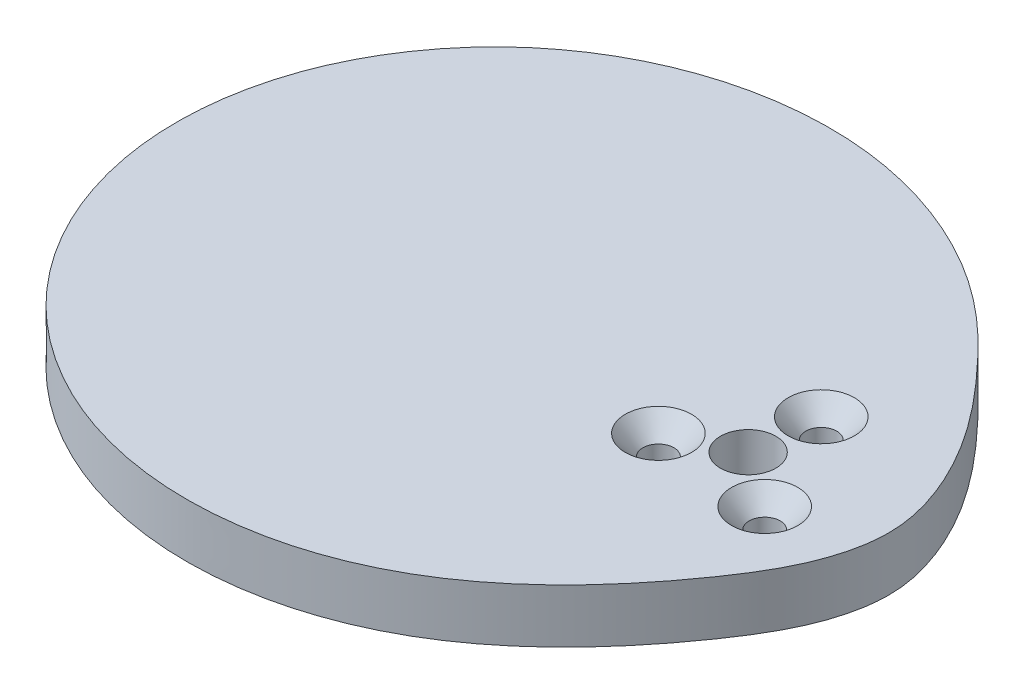
ISO-10303-21;
HEADER;
FILE_DESCRIPTION(('STEP AP214'),'2;1');
FILE_NAME('part.step','',(''),(''),'','','');
FILE_SCHEMA(('AUTOMOTIVE_DESIGN { 1 0 10303 214 1 1 1 1 }'));
ENDSEC;
DATA;
#1=APPLICATION_CONTEXT('core data for automotive mechanical design processes');
#2=APPLICATION_PROTOCOL_DEFINITION('international standard','automotive_design',2000,#1);
#3=PRODUCT_CONTEXT('',#1,'mechanical');
#4=PRODUCT('Part','Part','',(#3));
#5=PRODUCT_RELATED_PRODUCT_CATEGORY('part','',(#4));
#6=PRODUCT_DEFINITION_FORMATION('','',#4);
#7=PRODUCT_DEFINITION_CONTEXT('part definition',#1,'design');
#8=PRODUCT_DEFINITION('design','',#6,#7);
#9=PRODUCT_DEFINITION_SHAPE('','',#8);
#10=(LENGTH_UNIT() NAMED_UNIT(*) SI_UNIT(.MILLI.,.METRE.));
#11=(NAMED_UNIT(*) PLANE_ANGLE_UNIT() SI_UNIT($,.RADIAN.));
#12=(NAMED_UNIT(*) SI_UNIT($,.STERADIAN.) SOLID_ANGLE_UNIT());
#13=UNCERTAINTY_MEASURE_WITH_UNIT(LENGTH_MEASURE(1.E-05),#10,'distance_accuracy_value','');
#14=(GEOMETRIC_REPRESENTATION_CONTEXT(3) GLOBAL_UNCERTAINTY_ASSIGNED_CONTEXT((#13)) GLOBAL_UNIT_ASSIGNED_CONTEXT((#10,
#11,#12)) REPRESENTATION_CONTEXT('',''));
#15=CARTESIAN_POINT('',(0.,0.,0.));
#16=DIRECTION('',(0.,0.,1.));
#17=DIRECTION('',(1.,0.,0.));
#18=AXIS2_PLACEMENT_3D('',#15,#16,#17);
#19=CARTESIAN_POINT('',(-67.309703758411,3.175,0.0429080655897566));
#20=DIRECTION('',(0.,-1.,0.));
#21=DIRECTION('',(0.,0.,-1.));
#22=AXIS2_PLACEMENT_3D('',#19,#20,#21);
#23=PLANE('',#22);
#24=CARTESIAN_POINT('',(0.692905585992434,3.175,-7.919947088769));
#25=DIRECTION('',(0.,1.,0.));
#26=DIRECTION('',(0.,0.,1.));
#27=AXIS2_PLACEMENT_3D('',#24,#25,#26);
#28=CIRCLE('',#27,3.8989);
#29=CARTESIAN_POINT('',(0.692905585992434,3.175,-4.021047088769));
#30=VERTEX_POINT('',#29);
#31=EDGE_CURVE('E82',#30,#30,#28,.T.);
#32=ORIENTED_EDGE('',*,*,#31,.F.);
#33=EDGE_LOOP('',(#32));
#34=FACE_BOUND('',#33,.T.);
#35=CARTESIAN_POINT('',(6.51242258250635,3.175,4.56004738427809));
#36=DIRECTION('',(0.,1.,0.));
#37=DIRECTION('',(0.,0.,1.));
#38=AXIS2_PLACEMENT_3D('',#35,#36,#37);
#39=CIRCLE('',#38,3.8989);
#40=CARTESIAN_POINT('',(6.51242258250635,3.175,8.45894738427809));
#41=VERTEX_POINT('',#40);
#42=EDGE_CURVE('E73',#41,#41,#39,.T.);
#43=ORIENTED_EDGE('',*,*,#42,.F.);
#44=EDGE_LOOP('',(#43));
#45=FACE_BOUND('',#44,.T.);
#46=CARTESIAN_POINT('',(-7.20532816849878,3.175,3.35989970449091));
#47=DIRECTION('',(0.,1.,0.));
#48=DIRECTION('',(0.,0.,1.));
#49=AXIS2_PLACEMENT_3D('',#46,#47,#48);
#50=CIRCLE('',#49,3.8989);
#51=CARTESIAN_POINT('',(-7.20532816849878,3.175,7.25879970449091));
#52=VERTEX_POINT('',#51);
#53=EDGE_CURVE('E64',#52,#52,#50,.T.);
#54=ORIENTED_EDGE('',*,*,#53,.F.);
#55=EDGE_LOOP('',(#54));
#56=FACE_BOUND('',#55,.T.);
#57=CARTESIAN_POINT('',(16.51,3.175,0.));
#58=CARTESIAN_POINT('',(16.512122002573,3.175,-0.578131646519799));
#59=CARTESIAN_POINT('',(16.3846583915191,3.175,-2.98598611877512));
#60=CARTESIAN_POINT('',(13.9008239180821,3.175,-11.6057580205914));
#61=CARTESIAN_POINT('',(7.81098815372337,3.175,-19.1554395738624));
#62=CARTESIAN_POINT('',(0.397856736907535,3.175,-26.7536961850243));
#63=CARTESIAN_POINT('',(-7.91470950743928,3.175,-33.4536590544461));
#64=CARTESIAN_POINT('',(-20.8098565633673,3.175,-38.1868285045029));
#65=CARTESIAN_POINT('',(-34.9874097655524,3.175,-37.8511050802741));
#66=CARTESIAN_POINT('',(-46.3266954613286,3.175,-34.2823898342085));
#67=CARTESIAN_POINT('',(-57.6780062040442,3.175,-26.3363349220787));
#68=CARTESIAN_POINT('',(-64.5823910207053,3.175,-15.7009226628025));
#69=CARTESIAN_POINT('',(-66.8222897397395,3.175,-6.75822023120833));
#70=CARTESIAN_POINT('',(-67.2942783078794,3.175,-2.14394791372153));
#71=CARTESIAN_POINT('',(-67.3459097906533,3.175,1.42950713470104));
#72=CARTESIAN_POINT('',(-66.7893691824635,3.175,7.81537764898255));
#73=CARTESIAN_POINT('',(-63.7758632110471,3.175,17.4158880879559));
#74=CARTESIAN_POINT('',(-55.45225608504,3.175,28.4667005408489));
#75=CARTESIAN_POINT('',(-43.3404664219851,3.175,35.8292997083375));
#76=CARTESIAN_POINT('',(-29.5366229077802,3.175,38.57169193084));
#77=CARTESIAN_POINT('',(-16.8915865376864,3.175,36.9328459507109));
#78=CARTESIAN_POINT('',(-5.01795632776655,3.175,31.4822564672887));
#79=CARTESIAN_POINT('',(3.94648254449084,3.175,23.6476665698479));
#80=CARTESIAN_POINT('',(10.4684271193405,3.175,15.3397545631328));
#81=CARTESIAN_POINT('',(15.082180851912,3.175,7.95939064899721));
#82=CARTESIAN_POINT('',(16.499996307014,3.175,2.72546865444119));
#83=CARTESIAN_POINT('',(16.51,3.175,0.));
#84=B_SPLINE_CURVE_WITH_KNOTS('',3,(#57,#58,#59,#60,#61,#62,#63,#64,#65,#66,#67,#68,#69,#70,#71,
#72,#73,#74,#75,#76,#77,#78,#79,#80,#81,#82,#83),.UNSPECIFIED.,.T.,.F.,(4,1,1,1,1,1,1,1,1,1,1,1,
1,1,1,1,1,1,1,1,1,1,1,1,4),(0.,0.0070333789167307,0.0292863718609429,0.10776842687535,
0.121103964776265,0.15871765786092,0.237025969653857,0.281652422046204,0.329525954662369,
0.379560175377777,0.447772760523449,0.478100162193443,0.491134389207696,0.504172012077837,
0.521547705913641,0.569036322400201,0.624460033675861,0.686374731892615,0.737017153937418,
0.793225000860398,0.838519216882198,0.894255246616926,0.93625510806257,0.966842753051574,1.),.UNSPECIFIED.);
#85=CARTESIAN_POINT('',(16.51,3.175,0.));
#86=VERTEX_POINT('',#85);
#87=EDGE_CURVE('E10',#86,#86,#84,.T.);
#88=ORIENTED_EDGE('',*,*,#87,.T.);
#89=EDGE_LOOP('',(#88));
#90=FACE_BOUND('',#89,.T.);
#91=CARTESIAN_POINT('',(0.,3.175,0.));
#92=DIRECTION('',(0.,1.,0.));
#93=DIRECTION('',(0.,0.,1.));
#94=AXIS2_PLACEMENT_3D('',#91,#92,#93);
#95=CIRCLE('',#94,3.2639);
#96=CARTESIAN_POINT('',(0.,3.175,3.2639));
#97=VERTEX_POINT('',#96);
#98=EDGE_CURVE('E88',#97,#97,#95,.T.);
#99=ORIENTED_EDGE('',*,*,#98,.F.);
#100=EDGE_LOOP('',(#99));
#101=FACE_BOUND('',#100,.T.);
#102=ADVANCED_FACE('F38',(#34,#45,#56,#90,#101),#23,.F.);
#103=CARTESIAN_POINT('',(-67.309703758411,-3.175,0.0429080655897566));
#104=DIRECTION('',(0.,-1.,0.));
#105=DIRECTION('',(0.,0.,-1.));
#106=AXIS2_PLACEMENT_3D('',#103,#104,#105);
#107=PLANE('',#106);
#108=CARTESIAN_POINT('',(0.,-3.175,0.));
#109=DIRECTION('',(0.,1.,0.));
#110=DIRECTION('',(0.,0.,1.));
#111=AXIS2_PLACEMENT_3D('',#108,#109,#110);
#112=CIRCLE('',#111,3.2639);
#113=CARTESIAN_POINT('',(0.,-3.175,3.2639));
#114=VERTEX_POINT('',#113);
#115=EDGE_CURVE('E85',#114,#114,#112,.T.);
#116=ORIENTED_EDGE('',*,*,#115,.T.);
#117=EDGE_LOOP('',(#116));
#118=FACE_BOUND('',#117,.T.);
#119=CARTESIAN_POINT('',(0.692905585992434,-3.175,-7.919947088769));
#120=DIRECTION('',(0.,1.,0.));
#121=DIRECTION('',(0.,0.,1.));
#122=AXIS2_PLACEMENT_3D('',#119,#120,#121);
#123=CIRCLE('',#122,1.8288);
#124=CARTESIAN_POINT('',(0.692905585992434,-3.175,-6.09114708876901));
#125=VERTEX_POINT('',#124);
#126=EDGE_CURVE('E76',#125,#125,#123,.T.);
#127=ORIENTED_EDGE('',*,*,#126,.T.);
#128=EDGE_LOOP('',(#127));
#129=FACE_BOUND('',#128,.T.);
#130=CARTESIAN_POINT('',(16.51,-3.175,0.));
#131=CARTESIAN_POINT('',(16.512122002573,-3.175,-0.578131646519799));
#132=CARTESIAN_POINT('',(16.3846583915191,-3.175,-2.98598611877512));
#133=CARTESIAN_POINT('',(13.9008239180821,-3.175,-11.6057580205914));
#134=CARTESIAN_POINT('',(7.81098815372337,-3.175,-19.1554395738624));
#135=CARTESIAN_POINT('',(0.397856736907535,-3.175,-26.7536961850243));
#136=CARTESIAN_POINT('',(-7.91470950743928,-3.175,-33.4536590544461));
#137=CARTESIAN_POINT('',(-20.8098565633673,-3.175,-38.1868285045029));
#138=CARTESIAN_POINT('',(-34.9874097655524,-3.175,-37.8511050802741));
#139=CARTESIAN_POINT('',(-46.3266954613286,-3.175,-34.2823898342085));
#140=CARTESIAN_POINT('',(-57.6780062040442,-3.175,-26.3363349220787));
#141=CARTESIAN_POINT('',(-64.5823910207053,-3.175,-15.7009226628025));
#142=CARTESIAN_POINT('',(-66.8222897397395,-3.175,-6.75822023120833));
#143=CARTESIAN_POINT('',(-67.2942783078794,-3.175,-2.14394791372153));
#144=CARTESIAN_POINT('',(-67.3459097906533,-3.175,1.42950713470104));
#145=CARTESIAN_POINT('',(-66.7893691824635,-3.175,7.81537764898255));
#146=CARTESIAN_POINT('',(-63.7758632110471,-3.175,17.4158880879559));
#147=CARTESIAN_POINT('',(-55.45225608504,-3.175,28.4667005408489));
#148=CARTESIAN_POINT('',(-43.3404664219851,-3.175,35.8292997083375));
#149=CARTESIAN_POINT('',(-29.5366229077802,-3.175,38.57169193084));
#150=CARTESIAN_POINT('',(-16.8915865376864,-3.175,36.9328459507109));
#151=CARTESIAN_POINT('',(-5.01795632776655,-3.175,31.4822564672887));
#152=CARTESIAN_POINT('',(3.94648254449084,-3.175,23.6476665698479));
#153=CARTESIAN_POINT('',(10.4684271193405,-3.175,15.3397545631328));
#154=CARTESIAN_POINT('',(15.082180851912,-3.175,7.95939064899721));
#155=CARTESIAN_POINT('',(16.499996307014,-3.175,2.72546865444119));
#156=CARTESIAN_POINT('',(16.51,-3.175,0.));
#157=B_SPLINE_CURVE_WITH_KNOTS('',3,(#130,#131,#132,#133,#134,#135,#136,#137,#138,#139,#140,
#141,#142,#143,#144,#145,#146,#147,#148,#149,#150,#151,#152,#153,#154,#155,#156),.UNSPECIFIED.,
.T.,.F.,(4,1,1,1,1,1,1,1,1,1,1,1,1,1,1,1,1,1,1,1,1,1,1,1,4),(0.,0.0070333789167307,
0.0292863718609429,0.10776842687535,0.121103964776265,0.15871765786092,0.237025969653857,
0.281652422046204,0.329525954662369,0.379560175377777,0.447772760523449,0.478100162193443,
0.491134389207696,0.504172012077837,0.521547705913641,0.569036322400201,0.624460033675861,
0.686374731892615,0.737017153937418,0.793225000860398,0.838519216882198,0.894255246616926,
0.93625510806257,0.966842753051574,1.),.UNSPECIFIED.);
#158=CARTESIAN_POINT('',(16.51,-3.175,0.));
#159=VERTEX_POINT('',#158);
#160=EDGE_CURVE('E43',#159,#159,#157,.T.);
#161=ORIENTED_EDGE('',*,*,#160,.F.);
#162=EDGE_LOOP('',(#161));
#163=FACE_BOUND('',#162,.T.);
#164=CARTESIAN_POINT('',(-7.20532816849878,-3.175,3.35989970449091));
#165=DIRECTION('',(0.,1.,0.));
#166=DIRECTION('',(0.,0.,1.));
#167=AXIS2_PLACEMENT_3D('',#164,#165,#166);
#168=CIRCLE('',#167,1.8288);
#169=CARTESIAN_POINT('',(-7.20532816849878,-3.175,5.18869970449091));
#170=VERTEX_POINT('',#169);
#171=EDGE_CURVE('E51',#170,#170,#168,.T.);
#172=ORIENTED_EDGE('',*,*,#171,.T.);
#173=EDGE_LOOP('',(#172));
#174=FACE_BOUND('',#173,.T.);
#175=CARTESIAN_POINT('',(6.51242258250635,-3.175,4.56004738427809));
#176=DIRECTION('',(0.,1.,0.));
#177=DIRECTION('',(0.,0.,1.));
#178=AXIS2_PLACEMENT_3D('',#175,#176,#177);
#179=CIRCLE('',#178,1.8288);
#180=CARTESIAN_POINT('',(6.51242258250635,-3.175,6.38884738427809));
#181=VERTEX_POINT('',#180);
#182=EDGE_CURVE('E67',#181,#181,#179,.T.);
#183=ORIENTED_EDGE('',*,*,#182,.T.);
#184=EDGE_LOOP('',(#183));
#185=FACE_BOUND('',#184,.T.);
#186=ADVANCED_FACE('F95',(#118,#129,#163,#174,#185),#107,.T.);
#187=DIRECTION('',(0.,-1.,0.));
#188=VECTOR('',#187,1.);
#189=SURFACE_OF_LINEAR_EXTRUSION('',#84,#188);
#190=ORIENTED_EDGE('',*,*,#87,.F.);
#191=EDGE_LOOP('',(#190));
#192=FACE_BOUND('',#191,.T.);
#193=ORIENTED_EDGE('',*,*,#160,.T.);
#194=EDGE_LOOP('',(#193));
#195=FACE_BOUND('',#194,.T.);
#196=ADVANCED_FACE('F40',(#192,#195),#189,.F.);
#197=CARTESIAN_POINT('',(-7.20532816849878,3.175,3.35989970449091));
#198=DIRECTION('',(0.,1.,0.));
#199=DIRECTION('',(0.,0.,1.));
#200=AXIS2_PLACEMENT_3D('',#197,#198,#199);
#201=CYLINDRICAL_SURFACE('',#200,1.8288);
#202=ORIENTED_EDGE('',*,*,#171,.F.);
#203=EDGE_LOOP('',(#202));
#204=FACE_BOUND('',#203,.T.);
#205=CARTESIAN_POINT('',(-7.20532816849878,0.793622360211789,3.35989970449091));
#206=DIRECTION('',(0.,1.,0.));
#207=DIRECTION('',(0.,0.,1.));
#208=AXIS2_PLACEMENT_3D('',#205,#206,#207);
#209=CIRCLE('',#208,1.8288);
#210=CARTESIAN_POINT('',(-7.20532816849878,0.793622360211789,5.18869970449091));
#211=VERTEX_POINT('',#210);
#212=EDGE_CURVE('E61',#211,#211,#209,.T.);
#213=ORIENTED_EDGE('',*,*,#212,.T.);
#214=EDGE_LOOP('',(#213));
#215=FACE_BOUND('',#214,.T.);
#216=ADVANCED_FACE('F106',(#204,#215),#201,.F.);
#217=CARTESIAN_POINT('',(-7.20532816849878,3.175,3.35989970449091));
#218=DIRECTION('',(0.,1.,0.));
#219=DIRECTION('',(0.,0.,1.));
#220=AXIS2_PLACEMENT_3D('',#217,#218,#219);
#221=CONICAL_SURFACE('',#220,3.8989,0.715584993317676);
#222=ORIENTED_EDGE('',*,*,#212,.F.);
#223=EDGE_LOOP('',(#222));
#224=FACE_BOUND('',#223,.T.);
#225=ORIENTED_EDGE('',*,*,#53,.T.);
#226=EDGE_LOOP('',(#225));
#227=FACE_BOUND('',#226,.T.);
#228=ADVANCED_FACE('F109',(#224,#227),#221,.F.);
#229=CARTESIAN_POINT('',(6.51242258250635,3.175,4.56004738427809));
#230=DIRECTION('',(0.,1.,0.));
#231=DIRECTION('',(0.,0.,1.));
#232=AXIS2_PLACEMENT_3D('',#229,#230,#231);
#233=CYLINDRICAL_SURFACE('',#232,1.8288);
#234=ORIENTED_EDGE('',*,*,#182,.F.);
#235=EDGE_LOOP('',(#234));
#236=FACE_BOUND('',#235,.T.);
#237=CARTESIAN_POINT('',(6.51242258250635,0.793622360211789,4.56004738427809));
#238=DIRECTION('',(0.,1.,0.));
#239=DIRECTION('',(0.,0.,1.));
#240=AXIS2_PLACEMENT_3D('',#237,#238,#239);
#241=CIRCLE('',#240,1.8288);
#242=CARTESIAN_POINT('',(6.51242258250635,0.793622360211789,6.38884738427809));
#243=VERTEX_POINT('',#242);
#244=EDGE_CURVE('E70',#243,#243,#241,.T.);
#245=ORIENTED_EDGE('',*,*,#244,.T.);
#246=EDGE_LOOP('',(#245));
#247=FACE_BOUND('',#246,.T.);
#248=ADVANCED_FACE('F113',(#236,#247),#233,.F.);
#249=CARTESIAN_POINT('',(6.51242258250635,3.175,4.56004738427809));
#250=DIRECTION('',(0.,1.,0.));
#251=DIRECTION('',(0.,0.,1.));
#252=AXIS2_PLACEMENT_3D('',#249,#250,#251);
#253=CONICAL_SURFACE('',#252,3.8989,0.715584993317676);
#254=ORIENTED_EDGE('',*,*,#244,.F.);
#255=EDGE_LOOP('',(#254));
#256=FACE_BOUND('',#255,.T.);
#257=ORIENTED_EDGE('',*,*,#42,.T.);
#258=EDGE_LOOP('',(#257));
#259=FACE_BOUND('',#258,.T.);
#260=ADVANCED_FACE('F117',(#256,#259),#253,.F.);
#261=CARTESIAN_POINT('',(0.692905585992434,3.175,-7.919947088769));
#262=DIRECTION('',(0.,1.,0.));
#263=DIRECTION('',(0.,0.,1.));
#264=AXIS2_PLACEMENT_3D('',#261,#262,#263);
#265=CYLINDRICAL_SURFACE('',#264,1.8288);
#266=ORIENTED_EDGE('',*,*,#126,.F.);
#267=EDGE_LOOP('',(#266));
#268=FACE_BOUND('',#267,.T.);
#269=CARTESIAN_POINT('',(0.692905585992434,0.793622360211789,-7.919947088769));
#270=DIRECTION('',(0.,1.,0.));
#271=DIRECTION('',(0.,0.,1.));
#272=AXIS2_PLACEMENT_3D('',#269,#270,#271);
#273=CIRCLE('',#272,1.8288);
#274=CARTESIAN_POINT('',(0.692905585992434,0.793622360211789,-6.09114708876901));
#275=VERTEX_POINT('',#274);
#276=EDGE_CURVE('E79',#275,#275,#273,.T.);
#277=ORIENTED_EDGE('',*,*,#276,.T.);
#278=EDGE_LOOP('',(#277));
#279=FACE_BOUND('',#278,.T.);
#280=ADVANCED_FACE('F121',(#268,#279),#265,.F.);
#281=CARTESIAN_POINT('',(0.692905585992434,3.175,-7.919947088769));
#282=DIRECTION('',(0.,1.,0.));
#283=DIRECTION('',(0.,0.,1.));
#284=AXIS2_PLACEMENT_3D('',#281,#282,#283);
#285=CONICAL_SURFACE('',#284,3.8989,0.715584993317676);
#286=ORIENTED_EDGE('',*,*,#276,.F.);
#287=EDGE_LOOP('',(#286));
#288=FACE_BOUND('',#287,.T.);
#289=ORIENTED_EDGE('',*,*,#31,.T.);
#290=EDGE_LOOP('',(#289));
#291=FACE_BOUND('',#290,.T.);
#292=ADVANCED_FACE('F125',(#288,#291),#285,.F.);
#293=CARTESIAN_POINT('',(0.,3.175,0.));
#294=DIRECTION('',(0.,1.,0.));
#295=DIRECTION('',(0.,0.,1.));
#296=AXIS2_PLACEMENT_3D('',#293,#294,#295);
#297=CYLINDRICAL_SURFACE('',#296,3.2639);
#298=ORIENTED_EDGE('',*,*,#115,.F.);
#299=EDGE_LOOP('',(#298));
#300=FACE_BOUND('',#299,.T.);
#301=ORIENTED_EDGE('',*,*,#98,.T.);
#302=EDGE_LOOP('',(#301));
#303=FACE_BOUND('',#302,.T.);
#304=ADVANCED_FACE('F92',(#300,#303),#297,.F.);
#305=CLOSED_SHELL('',(#102,#186,#196,#216,#228,#248,#260,#280,#292,#304));
#306=MANIFOLD_SOLID_BREP('B2',#305);
#307=ADVANCED_BREP_SHAPE_REPRESENTATION('',(#18,#306),#14);
#308=SHAPE_DEFINITION_REPRESENTATION(#9,#307);
ENDSEC;
END-ISO-10303-21;
